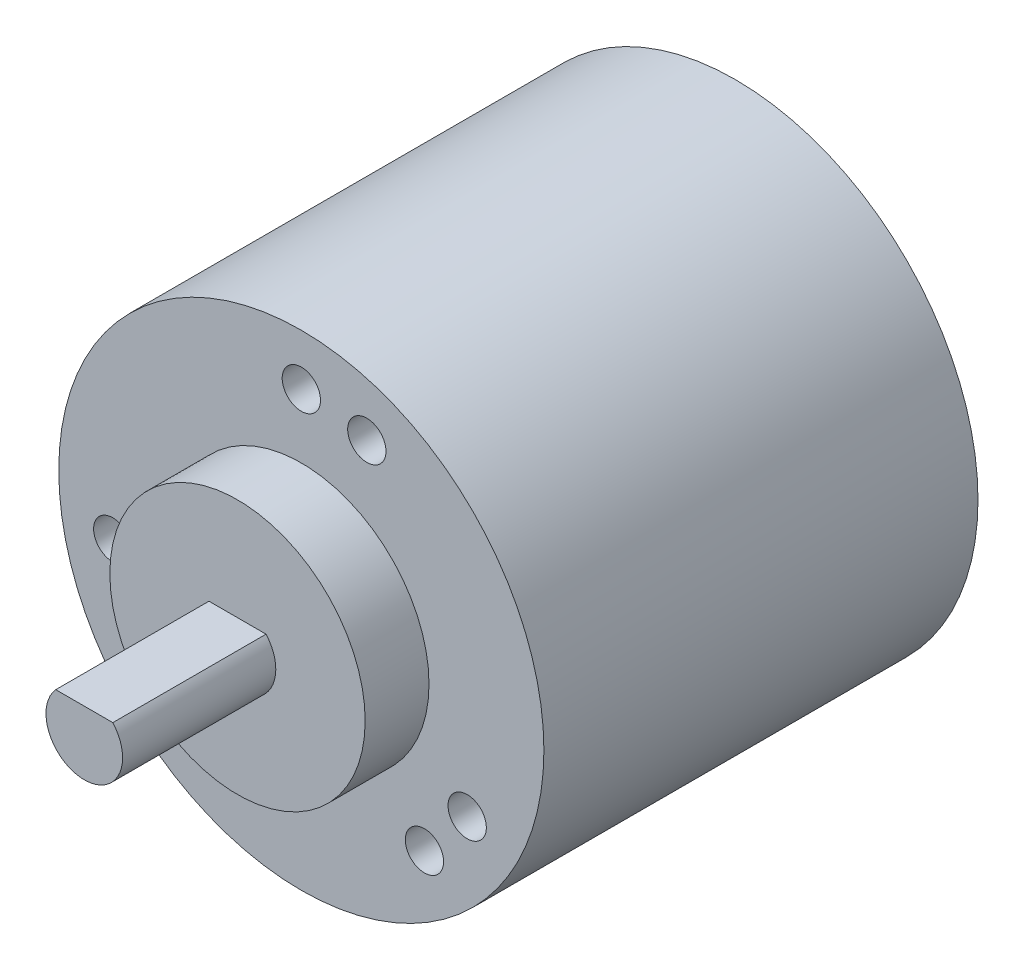
ISO-10303-21;
HEADER;
FILE_DESCRIPTION(('STEP AP214'),'2;1');
FILE_NAME('part.step','',(''),(''),'','','');
FILE_SCHEMA(('AUTOMOTIVE_DESIGN { 1 0 10303 214 1 1 1 1 }'));
ENDSEC;
DATA;
#1=APPLICATION_CONTEXT('core data for automotive mechanical design processes');
#2=APPLICATION_PROTOCOL_DEFINITION('international standard','automotive_design',2000,#1);
#3=PRODUCT_CONTEXT('',#1,'mechanical');
#4=PRODUCT('Part','Part','',(#3));
#5=PRODUCT_RELATED_PRODUCT_CATEGORY('part','',(#4));
#6=PRODUCT_DEFINITION_FORMATION('','',#4);
#7=PRODUCT_DEFINITION_CONTEXT('part definition',#1,'design');
#8=PRODUCT_DEFINITION('design','',#6,#7);
#9=PRODUCT_DEFINITION_SHAPE('','',#8);
#10=(LENGTH_UNIT() NAMED_UNIT(*) SI_UNIT(.MILLI.,.METRE.));
#11=(NAMED_UNIT(*) PLANE_ANGLE_UNIT() SI_UNIT($,.RADIAN.));
#12=(NAMED_UNIT(*) SI_UNIT($,.STERADIAN.) SOLID_ANGLE_UNIT());
#13=UNCERTAINTY_MEASURE_WITH_UNIT(LENGTH_MEASURE(1.E-05),#10,'distance_accuracy_value','');
#14=(GEOMETRIC_REPRESENTATION_CONTEXT(3) GLOBAL_UNCERTAINTY_ASSIGNED_CONTEXT((#13)) GLOBAL_UNIT_ASSIGNED_CONTEXT((#10,
#11,#12)) REPRESENTATION_CONTEXT('',''));
#15=CARTESIAN_POINT('',(0.,0.,0.));
#16=DIRECTION('',(0.,0.,1.));
#17=DIRECTION('',(1.,0.,0.));
#18=AXIS2_PLACEMENT_3D('',#15,#16,#17);
#19=CARTESIAN_POINT('',(0.,0.,34.));
#20=DIRECTION('',(0.,0.,-1.));
#21=DIRECTION('',(-1.,0.,0.));
#22=AXIS2_PLACEMENT_3D('',#19,#20,#21);
#23=CYLINDRICAL_SURFACE('',#22,19.);
#24=CARTESIAN_POINT('',(0.,0.,34.));
#25=DIRECTION('',(0.,0.,1.));
#26=DIRECTION('',(1.,0.,0.));
#27=AXIS2_PLACEMENT_3D('',#24,#25,#26);
#28=CIRCLE('',#27,19.);
#29=CARTESIAN_POINT('',(19.,0.,34.));
#30=VERTEX_POINT('',#29);
#31=EDGE_CURVE('E11',#30,#30,#28,.T.);
#32=ORIENTED_EDGE('',*,*,#31,.F.);
#33=EDGE_LOOP('',(#32));
#34=FACE_BOUND('',#33,.T.);
#35=CARTESIAN_POINT('',(0.,0.,0.));
#36=DIRECTION('',(0.,0.,1.));
#37=DIRECTION('',(1.,0.,0.));
#38=AXIS2_PLACEMENT_3D('',#35,#36,#37);
#39=CIRCLE('',#38,19.);
#40=CARTESIAN_POINT('',(19.,0.,0.));
#41=VERTEX_POINT('',#40);
#42=EDGE_CURVE('E41',#41,#41,#39,.T.);
#43=ORIENTED_EDGE('',*,*,#42,.T.);
#44=EDGE_LOOP('',(#43));
#45=FACE_BOUND('',#44,.T.);
#46=ADVANCED_FACE('F38',(#34,#45),#23,.T.);
#47=CARTESIAN_POINT('',(0.,0.,34.));
#48=DIRECTION('',(0.,0.,1.));
#49=DIRECTION('',(1.,0.,0.));
#50=AXIS2_PLACEMENT_3D('',#47,#48,#49);
#51=PLANE('',#50);
#52=CARTESIAN_POINT('',(0.,0.,34.));
#53=DIRECTION('',(0.,0.,1.));
#54=DIRECTION('',(1.,0.,0.));
#55=AXIS2_PLACEMENT_3D('',#52,#53,#54);
#56=CIRCLE('',#55,10.);
#57=CARTESIAN_POINT('',(10.,0.,34.));
#58=VERTEX_POINT('',#57);
#59=EDGE_CURVE('E80',#58,#58,#56,.T.);
#60=ORIENTED_EDGE('',*,*,#59,.F.);
#61=EDGE_LOOP('',(#60));
#62=FACE_BOUND('',#61,.T.);
#63=CARTESIAN_POINT('',(9.64181414529998,-11.4906666467843,34.));
#64=DIRECTION('',(0.,0.,1.));
#65=DIRECTION('',(1.,0.,0.));
#66=AXIS2_PLACEMENT_3D('',#63,#64,#65);
#67=CIRCLE('',#66,1.50000000000078);
#68=CARTESIAN_POINT('',(11.1418141453008,-11.4906666467843,34.));
#69=VERTEX_POINT('',#68);
#70=EDGE_CURVE('E87',#69,#69,#67,.T.);
#71=ORIENTED_EDGE('',*,*,#70,.F.);
#72=EDGE_LOOP('',(#71));
#73=FACE_BOUND('',#72,.T.);
#74=CARTESIAN_POINT('',(12.9903810567684,-7.49999999999967,34.));
#75=DIRECTION('',(0.,0.,1.));
#76=DIRECTION('',(1.,0.,0.));
#77=AXIS2_PLACEMENT_3D('',#74,#75,#76);
#78=CIRCLE('',#77,1.50000000000079);
#79=CARTESIAN_POINT('',(14.4903810567692,-7.49999999999967,34.));
#80=VERTEX_POINT('',#79);
#81=EDGE_CURVE('E112',#80,#80,#78,.T.);
#82=ORIENTED_EDGE('',*,*,#81,.F.);
#83=EDGE_LOOP('',(#82));
#84=FACE_BOUND('',#83,.T.);
#85=CARTESIAN_POINT('',(5.13030214988494,14.0953893117887,34.));
#86=DIRECTION('',(0.,0.,1.));
#87=DIRECTION('',(1.,0.,0.));
#88=AXIS2_PLACEMENT_3D('',#85,#86,#87);
#89=CIRCLE('',#88,1.5);
#90=CARTESIAN_POINT('',(6.63030214988494,14.0953893117887,34.));
#91=VERTEX_POINT('',#90);
#92=EDGE_CURVE('E106',#91,#91,#89,.T.);
#93=ORIENTED_EDGE('',*,*,#92,.F.);
#94=EDGE_LOOP('',(#93));
#95=FACE_BOUND('',#94,.T.);
#96=CARTESIAN_POINT('',(0.,15.,34.));
#97=DIRECTION('',(0.,0.,1.));
#98=DIRECTION('',(1.,0.,0.));
#99=AXIS2_PLACEMENT_3D('',#96,#97,#98);
#100=CIRCLE('',#99,1.5);
#101=CARTESIAN_POINT('',(1.5,15.,34.));
#102=VERTEX_POINT('',#101);
#103=EDGE_CURVE('E100',#102,#102,#100,.T.);
#104=ORIENTED_EDGE('',*,*,#103,.F.);
#105=EDGE_LOOP('',(#104));
#106=FACE_BOUND('',#105,.T.);
#107=CARTESIAN_POINT('',(-14.7721162951819,-2.60472266500547,34.));
#108=DIRECTION('',(0.,0.,1.));
#109=DIRECTION('',(1.,0.,0.));
#110=AXIS2_PLACEMENT_3D('',#107,#108,#109);
#111=CIRCLE('',#110,1.50000000000195);
#112=CARTESIAN_POINT('',(-13.27211629518,-2.60472266500547,34.));
#113=VERTEX_POINT('',#112);
#114=EDGE_CURVE('E94',#113,#113,#111,.T.);
#115=ORIENTED_EDGE('',*,*,#114,.F.);
#116=EDGE_LOOP('',(#115));
#117=FACE_BOUND('',#116,.T.);
#118=CARTESIAN_POINT('',(-12.9903810567654,-7.50000000000142,34.));
#119=DIRECTION('',(0.,0.,1.));
#120=DIRECTION('',(1.,0.,0.));
#121=AXIS2_PLACEMENT_3D('',#118,#119,#120);
#122=CIRCLE('',#121,1.50000000000197);
#123=CARTESIAN_POINT('',(-11.4903810567634,-7.50000000000142,34.));
#124=VERTEX_POINT('',#123);
#125=EDGE_CURVE('E93',#124,#124,#122,.T.);
#126=ORIENTED_EDGE('',*,*,#125,.F.);
#127=EDGE_LOOP('',(#126));
#128=FACE_BOUND('',#127,.T.);
#129=ORIENTED_EDGE('',*,*,#31,.T.);
#130=EDGE_LOOP('',(#129));
#131=FACE_BOUND('',#130,.T.);
#132=ADVANCED_FACE('F128',(#62,#73,#84,#95,#106,#117,#128,#131),#51,.T.);
#133=CARTESIAN_POINT('',(0.,0.,0.));
#134=DIRECTION('',(0.,0.,1.));
#135=DIRECTION('',(1.,0.,0.));
#136=AXIS2_PLACEMENT_3D('',#133,#134,#135);
#137=PLANE('',#136);
#138=ORIENTED_EDGE('',*,*,#42,.F.);
#139=EDGE_LOOP('',(#138));
#140=FACE_BOUND('',#139,.T.);
#141=ADVANCED_FACE('F131',(#140),#137,.F.);
#142=CARTESIAN_POINT('',(-12.9903810567654,-7.50000000000142,28.));
#143=DIRECTION('',(0.,0.,1.));
#144=DIRECTION('',(1.,0.,0.));
#145=AXIS2_PLACEMENT_3D('',#142,#143,#144);
#146=CYLINDRICAL_SURFACE('',#145,1.50000000000197);
#147=CARTESIAN_POINT('',(-12.9903810567654,-7.50000000000142,28.));
#148=DIRECTION('',(0.,0.,1.));
#149=DIRECTION('',(1.,0.,0.));
#150=AXIS2_PLACEMENT_3D('',#147,#148,#149);
#151=CIRCLE('',#150,1.50000000000197);
#152=CARTESIAN_POINT('',(-11.4903810567634,-7.50000000000142,28.));
#153=VERTEX_POINT('',#152);
#154=EDGE_CURVE('E120',#153,#153,#151,.T.);
#155=ORIENTED_EDGE('',*,*,#154,.F.);
#156=EDGE_LOOP('',(#155));
#157=FACE_BOUND('',#156,.T.);
#158=ORIENTED_EDGE('',*,*,#125,.T.);
#159=EDGE_LOOP('',(#158));
#160=FACE_BOUND('',#159,.T.);
#161=ADVANCED_FACE('F126',(#157,#160),#146,.F.);
#162=CARTESIAN_POINT('',(0.,0.,28.));
#163=DIRECTION('',(0.,0.,1.));
#164=DIRECTION('',(1.,0.,0.));
#165=AXIS2_PLACEMENT_3D('',#162,#163,#164);
#166=PLANE('',#165);
#167=ORIENTED_EDGE('',*,*,#154,.T.);
#168=EDGE_LOOP('',(#167));
#169=FACE_BOUND('',#168,.T.);
#170=ADVANCED_FACE('F145',(#169),#166,.T.);
#171=CARTESIAN_POINT('',(-14.7721162951819,-2.60472266500547,28.));
#172=DIRECTION('',(0.,0.,1.));
#173=DIRECTION('',(1.,0.,0.));
#174=AXIS2_PLACEMENT_3D('',#171,#172,#173);
#175=CYLINDRICAL_SURFACE('',#174,1.50000000000195);
#176=CARTESIAN_POINT('',(-14.7721162951819,-2.60472266500547,28.));
#177=DIRECTION('',(0.,0.,1.));
#178=DIRECTION('',(1.,0.,0.));
#179=AXIS2_PLACEMENT_3D('',#176,#177,#178);
#180=CIRCLE('',#179,1.50000000000195);
#181=CARTESIAN_POINT('',(-13.27211629518,-2.60472266500547,28.));
#182=VERTEX_POINT('',#181);
#183=EDGE_CURVE('E90',#182,#182,#180,.T.);
#184=ORIENTED_EDGE('',*,*,#183,.F.);
#185=EDGE_LOOP('',(#184));
#186=FACE_BOUND('',#185,.T.);
#187=ORIENTED_EDGE('',*,*,#114,.T.);
#188=EDGE_LOOP('',(#187));
#189=FACE_BOUND('',#188,.T.);
#190=ADVANCED_FACE('F151',(#186,#189),#175,.F.);
#191=CARTESIAN_POINT('',(0.,0.,28.));
#192=DIRECTION('',(0.,0.,1.));
#193=DIRECTION('',(1.,0.,0.));
#194=AXIS2_PLACEMENT_3D('',#191,#192,#193);
#195=PLANE('',#194);
#196=ORIENTED_EDGE('',*,*,#183,.T.);
#197=EDGE_LOOP('',(#196));
#198=FACE_BOUND('',#197,.T.);
#199=ADVANCED_FACE('F182',(#198),#195,.T.);
#200=CARTESIAN_POINT('',(0.,15.,28.));
#201=DIRECTION('',(0.,0.,1.));
#202=DIRECTION('',(1.,0.,0.));
#203=AXIS2_PLACEMENT_3D('',#200,#201,#202);
#204=CYLINDRICAL_SURFACE('',#203,1.5);
#205=CARTESIAN_POINT('',(0.,15.,28.));
#206=DIRECTION('',(0.,0.,1.));
#207=DIRECTION('',(1.,0.,0.));
#208=AXIS2_PLACEMENT_3D('',#205,#206,#207);
#209=CIRCLE('',#208,1.5);
#210=CARTESIAN_POINT('',(1.5,15.,28.));
#211=VERTEX_POINT('',#210);
#212=EDGE_CURVE('E97',#211,#211,#209,.T.);
#213=ORIENTED_EDGE('',*,*,#212,.F.);
#214=EDGE_LOOP('',(#213));
#215=FACE_BOUND('',#214,.T.);
#216=ORIENTED_EDGE('',*,*,#103,.T.);
#217=EDGE_LOOP('',(#216));
#218=FACE_BOUND('',#217,.T.);
#219=ADVANCED_FACE('F179',(#215,#218),#204,.F.);
#220=CARTESIAN_POINT('',(0.,0.,28.));
#221=DIRECTION('',(0.,0.,1.));
#222=DIRECTION('',(1.,0.,0.));
#223=AXIS2_PLACEMENT_3D('',#220,#221,#222);
#224=PLANE('',#223);
#225=ORIENTED_EDGE('',*,*,#212,.T.);
#226=EDGE_LOOP('',(#225));
#227=FACE_BOUND('',#226,.T.);
#228=ADVANCED_FACE('F174',(#227),#224,.T.);
#229=CARTESIAN_POINT('',(5.13030214988494,14.0953893117887,28.));
#230=DIRECTION('',(0.,0.,1.));
#231=DIRECTION('',(1.,0.,0.));
#232=AXIS2_PLACEMENT_3D('',#229,#230,#231);
#233=CYLINDRICAL_SURFACE('',#232,1.5);
#234=CARTESIAN_POINT('',(5.13030214988494,14.0953893117887,28.));
#235=DIRECTION('',(0.,0.,1.));
#236=DIRECTION('',(1.,0.,0.));
#237=AXIS2_PLACEMENT_3D('',#234,#235,#236);
#238=CIRCLE('',#237,1.5);
#239=CARTESIAN_POINT('',(6.63030214988494,14.0953893117887,28.));
#240=VERTEX_POINT('',#239);
#241=EDGE_CURVE('E103',#240,#240,#238,.T.);
#242=ORIENTED_EDGE('',*,*,#241,.F.);
#243=EDGE_LOOP('',(#242));
#244=FACE_BOUND('',#243,.T.);
#245=ORIENTED_EDGE('',*,*,#92,.T.);
#246=EDGE_LOOP('',(#245));
#247=FACE_BOUND('',#246,.T.);
#248=ADVANCED_FACE('F171',(#244,#247),#233,.F.);
#249=CARTESIAN_POINT('',(0.,0.,28.));
#250=DIRECTION('',(0.,0.,1.));
#251=DIRECTION('',(1.,0.,0.));
#252=AXIS2_PLACEMENT_3D('',#249,#250,#251);
#253=PLANE('',#252);
#254=ORIENTED_EDGE('',*,*,#241,.T.);
#255=EDGE_LOOP('',(#254));
#256=FACE_BOUND('',#255,.T.);
#257=ADVANCED_FACE('F166',(#256),#253,.T.);
#258=CARTESIAN_POINT('',(12.9903810567684,-7.49999999999967,28.));
#259=DIRECTION('',(0.,0.,1.));
#260=DIRECTION('',(1.,0.,0.));
#261=AXIS2_PLACEMENT_3D('',#258,#259,#260);
#262=CYLINDRICAL_SURFACE('',#261,1.50000000000079);
#263=CARTESIAN_POINT('',(12.9903810567684,-7.49999999999967,28.));
#264=DIRECTION('',(0.,0.,1.));
#265=DIRECTION('',(1.,0.,0.));
#266=AXIS2_PLACEMENT_3D('',#263,#264,#265);
#267=CIRCLE('',#266,1.50000000000079);
#268=CARTESIAN_POINT('',(14.4903810567692,-7.49999999999967,28.));
#269=VERTEX_POINT('',#268);
#270=EDGE_CURVE('E109',#269,#269,#267,.T.);
#271=ORIENTED_EDGE('',*,*,#270,.F.);
#272=EDGE_LOOP('',(#271));
#273=FACE_BOUND('',#272,.T.);
#274=ORIENTED_EDGE('',*,*,#81,.T.);
#275=EDGE_LOOP('',(#274));
#276=FACE_BOUND('',#275,.T.);
#277=ADVANCED_FACE('F163',(#273,#276),#262,.F.);
#278=CARTESIAN_POINT('',(0.,0.,28.));
#279=DIRECTION('',(0.,0.,1.));
#280=DIRECTION('',(1.,0.,0.));
#281=AXIS2_PLACEMENT_3D('',#278,#279,#280);
#282=PLANE('',#281);
#283=ORIENTED_EDGE('',*,*,#270,.T.);
#284=EDGE_LOOP('',(#283));
#285=FACE_BOUND('',#284,.T.);
#286=ADVANCED_FACE('F157',(#285),#282,.T.);
#287=CARTESIAN_POINT('',(9.64181414529998,-11.4906666467843,28.));
#288=DIRECTION('',(0.,0.,1.));
#289=DIRECTION('',(1.,0.,0.));
#290=AXIS2_PLACEMENT_3D('',#287,#288,#289);
#291=CYLINDRICAL_SURFACE('',#290,1.50000000000078);
#292=CARTESIAN_POINT('',(9.64181414529998,-11.4906666467843,28.));
#293=DIRECTION('',(0.,0.,1.));
#294=DIRECTION('',(1.,0.,0.));
#295=AXIS2_PLACEMENT_3D('',#292,#293,#294);
#296=CIRCLE('',#295,1.50000000000078);
#297=CARTESIAN_POINT('',(11.1418141453008,-11.4906666467843,28.));
#298=VERTEX_POINT('',#297);
#299=EDGE_CURVE('E115',#298,#298,#296,.T.);
#300=ORIENTED_EDGE('',*,*,#299,.F.);
#301=EDGE_LOOP('',(#300));
#302=FACE_BOUND('',#301,.T.);
#303=ORIENTED_EDGE('',*,*,#70,.T.);
#304=EDGE_LOOP('',(#303));
#305=FACE_BOUND('',#304,.T.);
#306=ADVANCED_FACE('F153',(#302,#305),#291,.F.);
#307=CARTESIAN_POINT('',(0.,0.,28.));
#308=DIRECTION('',(0.,0.,1.));
#309=DIRECTION('',(1.,0.,0.));
#310=AXIS2_PLACEMENT_3D('',#307,#308,#309);
#311=PLANE('',#310);
#312=ORIENTED_EDGE('',*,*,#299,.T.);
#313=EDGE_LOOP('',(#312));
#314=FACE_BOUND('',#313,.T.);
#315=ADVANCED_FACE('F156',(#314),#311,.T.);
#316=CARTESIAN_POINT('',(0.,0.,39.));
#317=DIRECTION('',(0.,0.,-1.));
#318=DIRECTION('',(-1.,0.,0.));
#319=AXIS2_PLACEMENT_3D('',#316,#317,#318);
#320=CYLINDRICAL_SURFACE('',#319,10.);
#321=CARTESIAN_POINT('',(0.,0.,39.));
#322=DIRECTION('',(0.,0.,1.));
#323=DIRECTION('',(1.,0.,0.));
#324=AXIS2_PLACEMENT_3D('',#321,#322,#323);
#325=CIRCLE('',#324,10.);
#326=CARTESIAN_POINT('',(10.,0.,39.));
#327=VERTEX_POINT('',#326);
#328=EDGE_CURVE('E84',#327,#327,#325,.T.);
#329=ORIENTED_EDGE('',*,*,#328,.F.);
#330=EDGE_LOOP('',(#329));
#331=FACE_BOUND('',#330,.T.);
#332=ORIENTED_EDGE('',*,*,#59,.T.);
#333=EDGE_LOOP('',(#332));
#334=FACE_BOUND('',#333,.T.);
#335=ADVANCED_FACE('F161',(#331,#334),#320,.T.);
#336=CARTESIAN_POINT('',(0.,0.,39.));
#337=DIRECTION('',(0.,0.,1.));
#338=DIRECTION('',(1.,0.,0.));
#339=AXIS2_PLACEMENT_3D('',#336,#337,#338);
#340=PLANE('',#339);
#341=DIRECTION('',(-1.,0.,0.));
#342=VECTOR('',#341,1.);
#343=CARTESIAN_POINT('',(0.,2.,39.));
#344=LINE('',#343,#342);
#345=CARTESIAN_POINT('',(2.23606797749979,2.,39.));
#346=VERTEX_POINT('',#345);
#347=CARTESIAN_POINT('',(-2.23606797749979,2.,39.));
#348=VERTEX_POINT('',#347);
#349=EDGE_CURVE('E64',#346,#348,#344,.T.);
#350=ORIENTED_EDGE('',*,*,#349,.F.);
#351=CARTESIAN_POINT('',(0.,0.,39.));
#352=DIRECTION('',(0.,0.,1.));
#353=DIRECTION('',(1.,0.,0.));
#354=AXIS2_PLACEMENT_3D('',#351,#352,#353);
#355=CIRCLE('',#354,3.);
#356=EDGE_CURVE('E51',#348,#346,#355,.T.);
#357=ORIENTED_EDGE('',*,*,#356,.F.);
#358=EDGE_LOOP('',(#350,#357));
#359=FACE_BOUND('',#358,.T.);
#360=ORIENTED_EDGE('',*,*,#328,.T.);
#361=EDGE_LOOP('',(#360));
#362=FACE_BOUND('',#361,.T.);
#363=ADVANCED_FACE('F65',(#359,#362),#340,.T.);
#364=CARTESIAN_POINT('',(0.,2.,51.));
#365=DIRECTION('',(0.,-1.,0.));
#366=DIRECTION('',(0.,0.,-1.));
#367=AXIS2_PLACEMENT_3D('',#364,#365,#366);
#368=PLANE('',#367);
#369=ORIENTED_EDGE('',*,*,#349,.T.);
#370=DIRECTION('',(0.,0.,-1.));
#371=VECTOR('',#370,1.);
#372=CARTESIAN_POINT('',(-2.23606797749979,2.,51.));
#373=LINE('',#372,#371);
#374=CARTESIAN_POINT('',(-2.23606797749979,2.,51.));
#375=VERTEX_POINT('',#374);
#376=EDGE_CURVE('E75',#375,#348,#373,.T.);
#377=ORIENTED_EDGE('',*,*,#376,.F.);
#378=DIRECTION('',(-1.,0.,0.));
#379=VECTOR('',#378,1.);
#380=CARTESIAN_POINT('',(0.,2.,51.));
#381=LINE('',#380,#379);
#382=CARTESIAN_POINT('',(2.23606797749979,2.,51.));
#383=VERTEX_POINT('',#382);
#384=EDGE_CURVE('E76',#383,#375,#381,.T.);
#385=ORIENTED_EDGE('',*,*,#384,.F.);
#386=DIRECTION('',(0.,0.,-1.));
#387=VECTOR('',#386,1.);
#388=CARTESIAN_POINT('',(2.23606797749979,2.,51.));
#389=LINE('',#388,#387);
#390=EDGE_CURVE('E73',#383,#346,#389,.T.);
#391=ORIENTED_EDGE('',*,*,#390,.T.);
#392=EDGE_LOOP('',(#369,#377,#385,#391));
#393=FACE_BOUND('',#392,.T.);
#394=ADVANCED_FACE('F78',(#393),#368,.F.);
#395=CARTESIAN_POINT('',(0.,0.,51.));
#396=DIRECTION('',(0.,0.,-1.));
#397=DIRECTION('',(-1.,0.,0.));
#398=AXIS2_PLACEMENT_3D('',#395,#396,#397);
#399=CYLINDRICAL_SURFACE('',#398,3.);
#400=ORIENTED_EDGE('',*,*,#356,.T.);
#401=ORIENTED_EDGE('',*,*,#390,.F.);
#402=CARTESIAN_POINT('',(0.,0.,51.));
#403=DIRECTION('',(0.,0.,1.));
#404=DIRECTION('',(1.,0.,0.));
#405=AXIS2_PLACEMENT_3D('',#402,#403,#404);
#406=CIRCLE('',#405,3.);
#407=EDGE_CURVE('E59',#375,#383,#406,.T.);
#408=ORIENTED_EDGE('',*,*,#407,.F.);
#409=ORIENTED_EDGE('',*,*,#376,.T.);
#410=EDGE_LOOP('',(#400,#401,#408,#409));
#411=FACE_BOUND('',#410,.T.);
#412=ADVANCED_FACE('F72',(#411),#399,.T.);
#413=CARTESIAN_POINT('',(0.,0.,51.));
#414=DIRECTION('',(0.,0.,1.));
#415=DIRECTION('',(1.,0.,0.));
#416=AXIS2_PLACEMENT_3D('',#413,#414,#415);
#417=PLANE('',#416);
#418=ORIENTED_EDGE('',*,*,#384,.T.);
#419=ORIENTED_EDGE('',*,*,#407,.T.);
#420=EDGE_LOOP('',(#418,#419));
#421=FACE_BOUND('',#420,.T.);
#422=ADVANCED_FACE('F202',(#421),#417,.T.);
#423=CLOSED_SHELL('',(#46,#132,#141,#161,#170,#190,#199,#219,#228,#248,#257,#277,#286,#306,#315,
#335,#363,#394,#412,#422));
#424=MANIFOLD_SOLID_BREP('B2',#423);
#425=ADVANCED_BREP_SHAPE_REPRESENTATION('',(#18,#424),#14);
#426=SHAPE_DEFINITION_REPRESENTATION(#9,#425);
ENDSEC;
END-ISO-10303-21;
